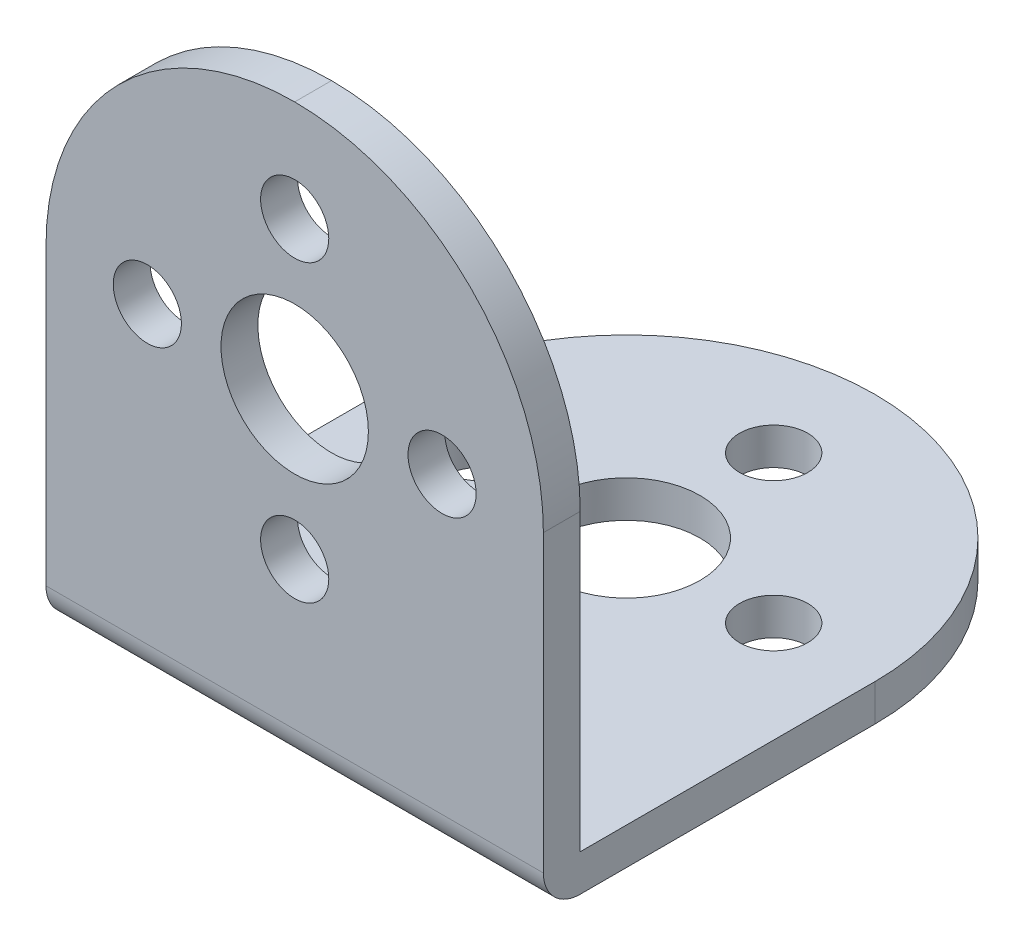
ISO-10303-21;
HEADER;
FILE_DESCRIPTION(('STEP AP214'),'2;1');
FILE_NAME('part.step','',(''),(''),'','','');
FILE_SCHEMA(('AUTOMOTIVE_DESIGN { 1 0 10303 214 1 1 1 1 }'));
ENDSEC;
DATA;
#1=APPLICATION_CONTEXT('core data for automotive mechanical design processes');
#2=APPLICATION_PROTOCOL_DEFINITION('international standard','automotive_design',2000,#1);
#3=PRODUCT_CONTEXT('',#1,'mechanical');
#4=PRODUCT('Part','Part','',(#3));
#5=PRODUCT_RELATED_PRODUCT_CATEGORY('part','',(#4));
#6=PRODUCT_DEFINITION_FORMATION('','',#4);
#7=PRODUCT_DEFINITION_CONTEXT('part definition',#1,'design');
#8=PRODUCT_DEFINITION('design','',#6,#7);
#9=PRODUCT_DEFINITION_SHAPE('','',#8);
#10=(LENGTH_UNIT() NAMED_UNIT(*) SI_UNIT(.MILLI.,.METRE.));
#11=(NAMED_UNIT(*) PLANE_ANGLE_UNIT() SI_UNIT($,.RADIAN.));
#12=(NAMED_UNIT(*) SI_UNIT($,.STERADIAN.) SOLID_ANGLE_UNIT());
#13=UNCERTAINTY_MEASURE_WITH_UNIT(LENGTH_MEASURE(1.E-05),#10,'distance_accuracy_value','');
#14=(GEOMETRIC_REPRESENTATION_CONTEXT(3) GLOBAL_UNCERTAINTY_ASSIGNED_CONTEXT((#13)) GLOBAL_UNIT_ASSIGNED_CONTEXT((#10,
#11,#12)) REPRESENTATION_CONTEXT('',''));
#15=CARTESIAN_POINT('',(0.,0.,0.));
#16=DIRECTION('',(0.,0.,1.));
#17=DIRECTION('',(1.,0.,0.));
#18=AXIS2_PLACEMENT_3D('',#15,#16,#17);
#19=CARTESIAN_POINT('',(-14.2564342321871,10.0253469559307,20.0384048243081));
#20=DIRECTION('',(0.,0.,1.));
#21=DIRECTION('',(0.,-1.,0.));
#22=AXIS2_PLACEMENT_3D('',#19,#20,#21);
#23=PLANE('',#22);
#24=CARTESIAN_POINT('',(-0.756434232187075,4.52534695593067,20.0384048243081));
#25=DIRECTION('',(0.,0.,1.));
#26=DIRECTION('',(1.,0.,0.));
#27=AXIS2_PLACEMENT_3D('',#24,#25,#26);
#28=CIRCLE('',#27,1.85);
#29=CARTESIAN_POINT('',(1.09356576781292,4.52534695593067,20.0384048243081));
#30=VERTEX_POINT('',#29);
#31=EDGE_CURVE('E156',#30,#30,#28,.T.);
#32=ORIENTED_EDGE('',*,*,#31,.F.);
#33=EDGE_LOOP('',(#32));
#34=FACE_BOUND('',#33,.T.);
#35=CARTESIAN_POINT('',(-0.756434232187075,-11.4746530440693,20.0384048243081));
#36=DIRECTION('',(0.,0.,1.));
#37=DIRECTION('',(1.,0.,0.));
#38=AXIS2_PLACEMENT_3D('',#35,#36,#37);
#39=CIRCLE('',#38,1.85);
#40=CARTESIAN_POINT('',(1.09356576781292,-11.4746530440693,20.0384048243081));
#41=VERTEX_POINT('',#40);
#42=EDGE_CURVE('E151',#41,#41,#39,.T.);
#43=ORIENTED_EDGE('',*,*,#42,.F.);
#44=EDGE_LOOP('',(#43));
#45=FACE_BOUND('',#44,.T.);
#46=CARTESIAN_POINT('',(-8.75643423218707,-3.47465304406933,20.0384048243081));
#47=DIRECTION('',(0.,0.,1.));
#48=DIRECTION('',(1.,0.,0.));
#49=AXIS2_PLACEMENT_3D('',#46,#47,#48);
#50=CIRCLE('',#49,1.85);
#51=CARTESIAN_POINT('',(-6.90643423218708,-3.47465304406933,20.0384048243081));
#52=VERTEX_POINT('',#51);
#53=EDGE_CURVE('E146',#52,#52,#50,.T.);
#54=ORIENTED_EDGE('',*,*,#53,.F.);
#55=EDGE_LOOP('',(#54));
#56=FACE_BOUND('',#55,.T.);
#57=CARTESIAN_POINT('',(7.24356576781292,-3.47465304406933,20.0384048243081));
#58=DIRECTION('',(0.,0.,1.));
#59=DIRECTION('',(1.,0.,0.));
#60=AXIS2_PLACEMENT_3D('',#57,#58,#59);
#61=CIRCLE('',#60,1.85);
#62=CARTESIAN_POINT('',(9.09356576781292,-3.47465304406933,20.0384048243081));
#63=VERTEX_POINT('',#62);
#64=EDGE_CURVE('E141',#63,#63,#61,.T.);
#65=ORIENTED_EDGE('',*,*,#64,.F.);
#66=EDGE_LOOP('',(#65));
#67=FACE_BOUND('',#66,.T.);
#68=CARTESIAN_POINT('',(-0.756434232187075,-3.47465304406933,20.0384048243081));
#69=DIRECTION('',(0.,0.,1.));
#70=DIRECTION('',(1.,0.,0.));
#71=AXIS2_PLACEMENT_3D('',#68,#69,#70);
#72=CIRCLE('',#71,4.);
#73=CARTESIAN_POINT('',(3.24356576781293,-3.47465304406933,20.0384048243081));
#74=VERTEX_POINT('',#73);
#75=EDGE_CURVE('E136',#74,#74,#72,.T.);
#76=ORIENTED_EDGE('',*,*,#75,.F.);
#77=EDGE_LOOP('',(#76));
#78=FACE_BOUND('',#77,.T.);
#79=DIRECTION('',(0.,-1.,0.));
#80=VECTOR('',#79,1.);
#81=CARTESIAN_POINT('',(-14.2564342321871,10.0253469559307,20.0384048243081));
#82=LINE('',#81,#80);
#83=CARTESIAN_POINT('',(-14.2564342321871,-3.47465304406933,20.0384048243081));
#84=VERTEX_POINT('',#83);
#85=CARTESIAN_POINT('',(-14.2564342321871,-19.4746530440693,20.0384048243081));
#86=VERTEX_POINT('',#85);
#87=EDGE_CURVE('E131',#84,#86,#82,.T.);
#88=ORIENTED_EDGE('',*,*,#87,.T.);
#89=DIRECTION('',(1.,0.,0.));
#90=VECTOR('',#89,1.);
#91=CARTESIAN_POINT('',(-14.2564342321871,-19.4746530440693,20.0384048243081));
#92=LINE('',#91,#90);
#93=CARTESIAN_POINT('',(12.7435657678129,-19.4746530440693,20.0384048243081));
#94=VERTEX_POINT('',#93);
#95=EDGE_CURVE('E202',#86,#94,#92,.T.);
#96=ORIENTED_EDGE('',*,*,#95,.T.);
#97=DIRECTION('',(0.,-1.,0.));
#98=VECTOR('',#97,1.);
#99=CARTESIAN_POINT('',(12.7435657678129,10.0253469559307,20.0384048243081));
#100=LINE('',#99,#98);
#101=CARTESIAN_POINT('',(12.7435657678129,-3.47465304406933,20.0384048243081));
#102=VERTEX_POINT('',#101);
#103=EDGE_CURVE('E120',#102,#94,#100,.T.);
#104=ORIENTED_EDGE('',*,*,#103,.F.);
#105=CARTESIAN_POINT('',(-0.756434232187075,-3.47465304406933,20.0384048243081));
#106=DIRECTION('',(0.,0.,1.));
#107=DIRECTION('',(0.,-1.,0.));
#108=AXIS2_PLACEMENT_3D('',#105,#106,#107);
#109=CIRCLE('',#108,13.5);
#110=CARTESIAN_POINT('',(-0.756434232187075,10.0253469559307,20.0384048243081));
#111=VERTEX_POINT('',#110);
#112=EDGE_CURVE('E160',#102,#111,#109,.T.);
#113=ORIENTED_EDGE('',*,*,#112,.T.);
#114=CARTESIAN_POINT('',(-0.756434232187075,-3.47465304406933,20.0384048243081));
#115=DIRECTION('',(0.,0.,1.));
#116=DIRECTION('',(0.,-1.,0.));
#117=AXIS2_PLACEMENT_3D('',#114,#115,#116);
#118=CIRCLE('',#117,13.5);
#119=EDGE_CURVE('E171',#111,#84,#118,.T.);
#120=ORIENTED_EDGE('',*,*,#119,.T.);
#121=EDGE_LOOP('',(#88,#96,#104,#113,#120));
#122=FACE_BOUND('',#121,.T.);
#123=ADVANCED_FACE('F16',(#34,#45,#56,#67,#78,#122),#23,.T.);
#124=CARTESIAN_POINT('',(-14.2564342321871,-19.4746530440693,18.0384048243081));
#125=DIRECTION('',(0.,0.,-1.));
#126=DIRECTION('',(0.,1.,0.));
#127=AXIS2_PLACEMENT_3D('',#124,#125,#126);
#128=PLANE('',#127);
#129=CARTESIAN_POINT('',(-0.756434232187075,4.52534695593067,18.0384048243081));
#130=DIRECTION('',(0.,0.,-1.));
#131=DIRECTION('',(0.,1.,0.));
#132=AXIS2_PLACEMENT_3D('',#129,#130,#131);
#133=CIRCLE('',#132,1.85);
#134=CARTESIAN_POINT('',(-0.756434232187075,6.37534695593067,18.0384048243081));
#135=VERTEX_POINT('',#134);
#136=EDGE_CURVE('E152',#135,#135,#133,.T.);
#137=ORIENTED_EDGE('',*,*,#136,.F.);
#138=EDGE_LOOP('',(#137));
#139=FACE_BOUND('',#138,.T.);
#140=CARTESIAN_POINT('',(-0.756434232187075,-11.4746530440693,18.0384048243081));
#141=DIRECTION('',(0.,0.,-1.));
#142=DIRECTION('',(0.,1.,0.));
#143=AXIS2_PLACEMENT_3D('',#140,#141,#142);
#144=CIRCLE('',#143,1.85);
#145=CARTESIAN_POINT('',(-0.756434232187075,-9.62465304406933,18.0384048243081));
#146=VERTEX_POINT('',#145);
#147=EDGE_CURVE('E147',#146,#146,#144,.T.);
#148=ORIENTED_EDGE('',*,*,#147,.F.);
#149=EDGE_LOOP('',(#148));
#150=FACE_BOUND('',#149,.T.);
#151=CARTESIAN_POINT('',(-8.75643423218707,-3.47465304406933,18.0384048243081));
#152=DIRECTION('',(0.,0.,-1.));
#153=DIRECTION('',(0.,1.,0.));
#154=AXIS2_PLACEMENT_3D('',#151,#152,#153);
#155=CIRCLE('',#154,1.85);
#156=CARTESIAN_POINT('',(-8.75643423218707,-1.62465304406933,18.0384048243081));
#157=VERTEX_POINT('',#156);
#158=EDGE_CURVE('E142',#157,#157,#155,.T.);
#159=ORIENTED_EDGE('',*,*,#158,.F.);
#160=EDGE_LOOP('',(#159));
#161=FACE_BOUND('',#160,.T.);
#162=CARTESIAN_POINT('',(7.24356576781292,-3.47465304406933,18.0384048243081));
#163=DIRECTION('',(0.,0.,-1.));
#164=DIRECTION('',(0.,1.,0.));
#165=AXIS2_PLACEMENT_3D('',#162,#163,#164);
#166=CIRCLE('',#165,1.85);
#167=CARTESIAN_POINT('',(7.24356576781292,-1.62465304406933,18.0384048243081));
#168=VERTEX_POINT('',#167);
#169=EDGE_CURVE('E137',#168,#168,#166,.T.);
#170=ORIENTED_EDGE('',*,*,#169,.F.);
#171=EDGE_LOOP('',(#170));
#172=FACE_BOUND('',#171,.T.);
#173=CARTESIAN_POINT('',(-0.756434232187075,-3.47465304406933,18.0384048243081));
#174=DIRECTION('',(0.,0.,-1.));
#175=DIRECTION('',(0.,1.,0.));
#176=AXIS2_PLACEMENT_3D('',#173,#174,#175);
#177=CIRCLE('',#176,4.);
#178=CARTESIAN_POINT('',(-0.756434232187075,0.525346955930675,18.0384048243081));
#179=VERTEX_POINT('',#178);
#180=EDGE_CURVE('E124',#179,#179,#177,.T.);
#181=ORIENTED_EDGE('',*,*,#180,.F.);
#182=EDGE_LOOP('',(#181));
#183=FACE_BOUND('',#182,.T.);
#184=DIRECTION('',(0.,1.,0.));
#185=VECTOR('',#184,1.);
#186=CARTESIAN_POINT('',(-14.2564342321871,-19.4746530440693,18.0384048243081));
#187=LINE('',#186,#185);
#188=CARTESIAN_POINT('',(-14.2564342321871,-19.4746530440693,18.0384048243081));
#189=VERTEX_POINT('',#188);
#190=CARTESIAN_POINT('',(-14.2564342321871,-3.47465304406933,18.0384048243081));
#191=VERTEX_POINT('',#190);
#192=EDGE_CURVE('E99',#189,#191,#187,.T.);
#193=ORIENTED_EDGE('',*,*,#192,.T.);
#194=CARTESIAN_POINT('',(-0.756434232187075,-3.47465304406933,18.0384048243081));
#195=DIRECTION('',(0.,0.,-1.));
#196=DIRECTION('',(0.,1.,0.));
#197=AXIS2_PLACEMENT_3D('',#194,#195,#196);
#198=CIRCLE('',#197,13.5);
#199=CARTESIAN_POINT('',(-0.756434232187075,10.0253469559307,18.0384048243081));
#200=VERTEX_POINT('',#199);
#201=EDGE_CURVE('E176',#191,#200,#198,.T.);
#202=ORIENTED_EDGE('',*,*,#201,.T.);
#203=CARTESIAN_POINT('',(-0.756434232187075,-3.47465304406933,18.0384048243081));
#204=DIRECTION('',(0.,0.,-1.));
#205=DIRECTION('',(0.,1.,0.));
#206=AXIS2_PLACEMENT_3D('',#203,#204,#205);
#207=CIRCLE('',#206,13.5);
#208=CARTESIAN_POINT('',(12.7435657678129,-3.47465304406933,18.0384048243081));
#209=VERTEX_POINT('',#208);
#210=EDGE_CURVE('E168',#200,#209,#207,.T.);
#211=ORIENTED_EDGE('',*,*,#210,.T.);
#212=DIRECTION('',(0.,1.,0.));
#213=VECTOR('',#212,1.);
#214=CARTESIAN_POINT('',(12.7435657678129,-19.4746530440693,18.0384048243081));
#215=LINE('',#214,#213);
#216=CARTESIAN_POINT('',(12.7435657678129,-19.4746530440693,18.0384048243081));
#217=VERTEX_POINT('',#216);
#218=EDGE_CURVE('E107',#217,#209,#215,.T.);
#219=ORIENTED_EDGE('',*,*,#218,.F.);
#220=DIRECTION('',(1.,0.,0.));
#221=VECTOR('',#220,1.);
#222=CARTESIAN_POINT('',(-14.2564342321871,-19.4746530440693,18.0384048243081));
#223=LINE('',#222,#221);
#224=EDGE_CURVE('E91',#189,#217,#223,.T.);
#225=ORIENTED_EDGE('',*,*,#224,.F.);
#226=EDGE_LOOP('',(#193,#202,#211,#219,#225));
#227=FACE_BOUND('',#226,.T.);
#228=ADVANCED_FACE('F104',(#139,#150,#161,#172,#183,#227),#128,.T.);
#229=CARTESIAN_POINT('',(-14.2564342321871,-19.4746530440693,-11.4615951756919));
#230=DIRECTION('',(0.,1.,0.));
#231=DIRECTION('',(0.,0.,1.));
#232=AXIS2_PLACEMENT_3D('',#229,#230,#231);
#233=PLANE('',#232);
#234=CARTESIAN_POINT('',(-0.756434232187075,-19.4746530440693,10.0384048243081));
#235=DIRECTION('',(0.,1.,0.));
#236=DIRECTION('',(0.,0.,1.));
#237=AXIS2_PLACEMENT_3D('',#234,#235,#236);
#238=CIRCLE('',#237,1.85);
#239=CARTESIAN_POINT('',(-0.756434232187075,-19.4746530440693,11.8884048243081));
#240=VERTEX_POINT('',#239);
#241=EDGE_CURVE('E301',#240,#240,#238,.T.);
#242=ORIENTED_EDGE('',*,*,#241,.F.);
#243=EDGE_LOOP('',(#242));
#244=FACE_BOUND('',#243,.T.);
#245=CARTESIAN_POINT('',(-0.756434232187075,-19.4746530440693,-5.96159517569185));
#246=DIRECTION('',(0.,1.,0.));
#247=DIRECTION('',(0.,0.,1.));
#248=AXIS2_PLACEMENT_3D('',#245,#246,#247);
#249=CIRCLE('',#248,1.85);
#250=CARTESIAN_POINT('',(-0.756434232187075,-19.4746530440693,-4.11159517569186));
#251=VERTEX_POINT('',#250);
#252=EDGE_CURVE('E314',#251,#251,#249,.T.);
#253=ORIENTED_EDGE('',*,*,#252,.F.);
#254=EDGE_LOOP('',(#253));
#255=FACE_BOUND('',#254,.T.);
#256=CARTESIAN_POINT('',(-8.75643423218707,-19.4746530440693,2.03840482430815));
#257=DIRECTION('',(0.,1.,0.));
#258=DIRECTION('',(0.,0.,1.));
#259=AXIS2_PLACEMENT_3D('',#256,#257,#258);
#260=CIRCLE('',#259,1.85);
#261=CARTESIAN_POINT('',(-8.75643423218707,-19.4746530440693,3.88840482430814));
#262=VERTEX_POINT('',#261);
#263=EDGE_CURVE('E322',#262,#262,#260,.T.);
#264=ORIENTED_EDGE('',*,*,#263,.F.);
#265=EDGE_LOOP('',(#264));
#266=FACE_BOUND('',#265,.T.);
#267=CARTESIAN_POINT('',(7.24356576781292,-19.4746530440693,2.03840482430815));
#268=DIRECTION('',(0.,1.,0.));
#269=DIRECTION('',(0.,0.,1.));
#270=AXIS2_PLACEMENT_3D('',#267,#268,#269);
#271=CIRCLE('',#270,1.85);
#272=CARTESIAN_POINT('',(7.24356576781292,-19.4746530440693,3.88840482430814));
#273=VERTEX_POINT('',#272);
#274=EDGE_CURVE('E330',#273,#273,#271,.T.);
#275=ORIENTED_EDGE('',*,*,#274,.F.);
#276=EDGE_LOOP('',(#275));
#277=FACE_BOUND('',#276,.T.);
#278=CARTESIAN_POINT('',(-0.756434232187075,-19.4746530440693,2.03840482430815));
#279=DIRECTION('',(0.,1.,0.));
#280=DIRECTION('',(0.,0.,1.));
#281=AXIS2_PLACEMENT_3D('',#278,#279,#280);
#282=CIRCLE('',#281,4.);
#283=CARTESIAN_POINT('',(-0.756434232187075,-19.4746530440693,6.03840482430815));
#284=VERTEX_POINT('',#283);
#285=EDGE_CURVE('E338',#284,#284,#282,.T.);
#286=ORIENTED_EDGE('',*,*,#285,.F.);
#287=EDGE_LOOP('',(#286));
#288=FACE_BOUND('',#287,.T.);
#289=CARTESIAN_POINT('',(-0.756434232187075,-19.4746530440693,2.03840482430814));
#290=DIRECTION('',(0.,1.,0.));
#291=DIRECTION('',(0.,0.,1.));
#292=AXIS2_PLACEMENT_3D('',#289,#290,#291);
#293=CIRCLE('',#292,13.5);
#294=CARTESIAN_POINT('',(12.7435657678129,-19.4746530440693,2.03840482430814));
#295=VERTEX_POINT('',#294);
#296=CARTESIAN_POINT('',(-0.756434232187075,-19.4746530440693,-11.4615951756919));
#297=VERTEX_POINT('',#296);
#298=EDGE_CURVE('E183',#295,#297,#293,.T.);
#299=ORIENTED_EDGE('',*,*,#298,.T.);
#300=CARTESIAN_POINT('',(-0.756434232187075,-19.4746530440693,2.03840482430814));
#301=DIRECTION('',(0.,1.,0.));
#302=DIRECTION('',(0.,0.,1.));
#303=AXIS2_PLACEMENT_3D('',#300,#301,#302);
#304=CIRCLE('',#303,13.5);
#305=CARTESIAN_POINT('',(-14.2564342321871,-19.4746530440693,2.03840482430814));
#306=VERTEX_POINT('',#305);
#307=EDGE_CURVE('E93',#297,#306,#304,.T.);
#308=ORIENTED_EDGE('',*,*,#307,.T.);
#309=DIRECTION('',(0.,0.,1.));
#310=VECTOR('',#309,1.);
#311=CARTESIAN_POINT('',(-14.2564342321871,-19.4746530440693,-11.4615951756919));
#312=LINE('',#311,#310);
#313=EDGE_CURVE('E86',#306,#189,#312,.T.);
#314=ORIENTED_EDGE('',*,*,#313,.T.);
#315=ORIENTED_EDGE('',*,*,#224,.T.);
#316=DIRECTION('',(0.,0.,1.));
#317=VECTOR('',#316,1.);
#318=CARTESIAN_POINT('',(12.7435657678129,-19.4746530440693,-11.4615951756919));
#319=LINE('',#318,#317);
#320=EDGE_CURVE('E127',#295,#217,#319,.T.);
#321=ORIENTED_EDGE('',*,*,#320,.F.);
#322=EDGE_LOOP('',(#299,#308,#314,#315,#321));
#323=FACE_BOUND('',#322,.T.);
#324=ADVANCED_FACE('F89',(#244,#255,#266,#277,#288,#323),#233,.T.);
#325=CARTESIAN_POINT('',(-14.2564342321871,-21.4746530440693,20.0384048243081));
#326=DIRECTION('',(0.,-1.,0.));
#327=DIRECTION('',(0.,0.,-1.));
#328=AXIS2_PLACEMENT_3D('',#325,#326,#327);
#329=PLANE('',#328);
#330=CARTESIAN_POINT('',(-0.756434232187075,-21.4746530440693,10.0384048243081));
#331=DIRECTION('',(0.,-1.,0.));
#332=DIRECTION('',(0.,0.,-1.));
#333=AXIS2_PLACEMENT_3D('',#330,#331,#332);
#334=CIRCLE('',#333,1.85);
#335=CARTESIAN_POINT('',(-0.756434232187075,-21.4746530440693,8.18840482430815));
#336=VERTEX_POINT('',#335);
#337=EDGE_CURVE('E304',#336,#336,#334,.T.);
#338=ORIENTED_EDGE('',*,*,#337,.F.);
#339=EDGE_LOOP('',(#338));
#340=FACE_BOUND('',#339,.T.);
#341=CARTESIAN_POINT('',(-0.756434232187075,-21.4746530440693,-5.96159517569185));
#342=DIRECTION('',(0.,-1.,0.));
#343=DIRECTION('',(0.,0.,-1.));
#344=AXIS2_PLACEMENT_3D('',#341,#342,#343);
#345=CIRCLE('',#344,1.85);
#346=CARTESIAN_POINT('',(-0.756434232187075,-21.4746530440693,-7.81159517569185));
#347=VERTEX_POINT('',#346);
#348=EDGE_CURVE('E308',#347,#347,#345,.T.);
#349=ORIENTED_EDGE('',*,*,#348,.F.);
#350=EDGE_LOOP('',(#349));
#351=FACE_BOUND('',#350,.T.);
#352=CARTESIAN_POINT('',(-8.75643423218707,-21.4746530440693,2.03840482430815));
#353=DIRECTION('',(0.,-1.,0.));
#354=DIRECTION('',(0.,0.,-1.));
#355=AXIS2_PLACEMENT_3D('',#352,#353,#354);
#356=CIRCLE('',#355,1.85);
#357=CARTESIAN_POINT('',(-8.75643423218707,-21.4746530440693,0.18840482430815));
#358=VERTEX_POINT('',#357);
#359=EDGE_CURVE('E318',#358,#358,#356,.T.);
#360=ORIENTED_EDGE('',*,*,#359,.F.);
#361=EDGE_LOOP('',(#360));
#362=FACE_BOUND('',#361,.T.);
#363=CARTESIAN_POINT('',(7.24356576781292,-21.4746530440693,2.03840482430815));
#364=DIRECTION('',(0.,-1.,0.));
#365=DIRECTION('',(0.,0.,-1.));
#366=AXIS2_PLACEMENT_3D('',#363,#364,#365);
#367=CIRCLE('',#366,1.85);
#368=CARTESIAN_POINT('',(7.24356576781292,-21.4746530440693,0.18840482430815));
#369=VERTEX_POINT('',#368);
#370=EDGE_CURVE('E326',#369,#369,#367,.T.);
#371=ORIENTED_EDGE('',*,*,#370,.F.);
#372=EDGE_LOOP('',(#371));
#373=FACE_BOUND('',#372,.T.);
#374=CARTESIAN_POINT('',(-0.756434232187075,-21.4746530440693,2.03840482430815));
#375=DIRECTION('',(0.,-1.,0.));
#376=DIRECTION('',(0.,0.,-1.));
#377=AXIS2_PLACEMENT_3D('',#374,#375,#376);
#378=CIRCLE('',#377,4.);
#379=CARTESIAN_POINT('',(-0.756434232187075,-21.4746530440693,-1.96159517569186));
#380=VERTEX_POINT('',#379);
#381=EDGE_CURVE('E334',#380,#380,#378,.T.);
#382=ORIENTED_EDGE('',*,*,#381,.F.);
#383=EDGE_LOOP('',(#382));
#384=FACE_BOUND('',#383,.T.);
#385=DIRECTION('',(0.,0.,-1.));
#386=VECTOR('',#385,1.);
#387=CARTESIAN_POINT('',(12.7435657678129,-21.4746530440693,20.0384048243081));
#388=LINE('',#387,#386);
#389=CARTESIAN_POINT('',(12.7435657678129,-21.4746530440693,18.0384048243081));
#390=VERTEX_POINT('',#389);
#391=CARTESIAN_POINT('',(12.7435657678129,-21.4746530440693,2.03840482430814));
#392=VERTEX_POINT('',#391);
#393=EDGE_CURVE('E123',#390,#392,#388,.T.);
#394=ORIENTED_EDGE('',*,*,#393,.F.);
#395=DIRECTION('',(1.,0.,0.));
#396=VECTOR('',#395,1.);
#397=CARTESIAN_POINT('',(-14.2564342321871,-21.4746530440693,18.0384048243081));
#398=LINE('',#397,#396);
#399=CARTESIAN_POINT('',(-14.2564342321871,-21.4746530440693,18.0384048243081));
#400=VERTEX_POINT('',#399);
#401=EDGE_CURVE('E25',#390,#400,#398,.F.);
#402=ORIENTED_EDGE('',*,*,#401,.T.);
#403=DIRECTION('',(0.,0.,-1.));
#404=VECTOR('',#403,1.);
#405=CARTESIAN_POINT('',(-14.2564342321871,-21.4746530440693,20.0384048243081));
#406=LINE('',#405,#404);
#407=CARTESIAN_POINT('',(-14.2564342321871,-21.4746530440693,2.03840482430814));
#408=VERTEX_POINT('',#407);
#409=EDGE_CURVE('E100',#400,#408,#406,.T.);
#410=ORIENTED_EDGE('',*,*,#409,.T.);
#411=CARTESIAN_POINT('',(-0.756434232187075,-21.4746530440693,2.03840482430814));
#412=DIRECTION('',(0.,-1.,0.));
#413=DIRECTION('',(0.,0.,-1.));
#414=AXIS2_PLACEMENT_3D('',#411,#412,#413);
#415=CIRCLE('',#414,13.5);
#416=CARTESIAN_POINT('',(-0.756434232187075,-21.4746530440693,-11.4615951756919));
#417=VERTEX_POINT('',#416);
#418=EDGE_CURVE('E199',#408,#417,#415,.T.);
#419=ORIENTED_EDGE('',*,*,#418,.T.);
#420=CARTESIAN_POINT('',(-0.756434232187075,-21.4746530440693,2.03840482430814));
#421=DIRECTION('',(0.,-1.,0.));
#422=DIRECTION('',(0.,0.,-1.));
#423=AXIS2_PLACEMENT_3D('',#420,#421,#422);
#424=CIRCLE('',#423,13.5);
#425=EDGE_CURVE('E190',#417,#392,#424,.T.);
#426=ORIENTED_EDGE('',*,*,#425,.T.);
#427=EDGE_LOOP('',(#394,#402,#410,#419,#426));
#428=FACE_BOUND('',#427,.T.);
#429=ADVANCED_FACE('F248',(#340,#351,#362,#373,#384,#428),#329,.T.);
#430=CARTESIAN_POINT('',(-14.2564342321871,-21.4746530440693,20.0384048243081));
#431=DIRECTION('',(1.,0.,0.));
#432=DIRECTION('',(0.,0.,-1.));
#433=AXIS2_PLACEMENT_3D('',#430,#431,#432);
#434=PLANE('',#433);
#435=ORIENTED_EDGE('',*,*,#409,.F.);
#436=CARTESIAN_POINT('',(-14.2564342321871,-19.4746530440693,18.0384048243081));
#437=DIRECTION('',(1.,0.,0.));
#438=DIRECTION('',(0.,0.,-1.));
#439=AXIS2_PLACEMENT_3D('',#436,#437,#438);
#440=CIRCLE('',#439,2.);
#441=EDGE_CURVE('E11',#400,#86,#440,.F.);
#442=ORIENTED_EDGE('',*,*,#441,.T.);
#443=ORIENTED_EDGE('',*,*,#87,.F.);
#444=DIRECTION('',(0.,0.,1.));
#445=VECTOR('',#444,1.);
#446=CARTESIAN_POINT('',(-14.2564342321871,-3.47465304406933,18.0384048243081));
#447=LINE('',#446,#445);
#448=EDGE_CURVE('E114',#84,#191,#447,.F.);
#449=ORIENTED_EDGE('',*,*,#448,.T.);
#450=ORIENTED_EDGE('',*,*,#192,.F.);
#451=ORIENTED_EDGE('',*,*,#313,.F.);
#452=DIRECTION('',(0.,1.,0.));
#453=VECTOR('',#452,1.);
#454=CARTESIAN_POINT('',(-14.2564342321871,-21.4746530440693,2.03840482430814));
#455=LINE('',#454,#453);
#456=EDGE_CURVE('E196',#306,#408,#455,.F.);
#457=ORIENTED_EDGE('',*,*,#456,.T.);
#458=EDGE_LOOP('',(#435,#442,#443,#449,#450,#451,#457));
#459=FACE_BOUND('',#458,.T.);
#460=ADVANCED_FACE('F111',(#459),#434,.F.);
#461=CARTESIAN_POINT('',(12.7435657678129,-21.4746530440693,20.0384048243081));
#462=DIRECTION('',(1.,0.,0.));
#463=DIRECTION('',(0.,0.,-1.));
#464=AXIS2_PLACEMENT_3D('',#461,#462,#463);
#465=PLANE('',#464);
#466=ORIENTED_EDGE('',*,*,#103,.T.);
#467=CARTESIAN_POINT('',(12.7435657678129,-19.4746530440693,18.0384048243081));
#468=DIRECTION('',(1.,0.,0.));
#469=DIRECTION('',(0.,0.,-1.));
#470=AXIS2_PLACEMENT_3D('',#467,#468,#469);
#471=CIRCLE('',#470,2.);
#472=EDGE_CURVE('E39',#94,#390,#471,.T.);
#473=ORIENTED_EDGE('',*,*,#472,.T.);
#474=ORIENTED_EDGE('',*,*,#393,.T.);
#475=DIRECTION('',(0.,1.,0.));
#476=VECTOR('',#475,1.);
#477=CARTESIAN_POINT('',(12.7435657678129,-21.4746530440693,2.03840482430814));
#478=LINE('',#477,#476);
#479=EDGE_CURVE('E179',#392,#295,#478,.T.);
#480=ORIENTED_EDGE('',*,*,#479,.T.);
#481=ORIENTED_EDGE('',*,*,#320,.T.);
#482=ORIENTED_EDGE('',*,*,#218,.T.);
#483=DIRECTION('',(0.,0.,1.));
#484=VECTOR('',#483,1.);
#485=CARTESIAN_POINT('',(12.7435657678129,-3.47465304406933,20.0384048243081));
#486=LINE('',#485,#484);
#487=EDGE_CURVE('E109',#209,#102,#486,.T.);
#488=ORIENTED_EDGE('',*,*,#487,.T.);
#489=EDGE_LOOP('',(#466,#473,#474,#480,#481,#482,#488));
#490=FACE_BOUND('',#489,.T.);
#491=ADVANCED_FACE('F216',(#490),#465,.T.);
#492=CARTESIAN_POINT('',(-0.756434232187075,-3.47465304406933,-11.4615951756919));
#493=DIRECTION('',(0.,0.,1.));
#494=DIRECTION('',(1.,0.,0.));
#495=AXIS2_PLACEMENT_3D('',#492,#493,#494);
#496=CYLINDRICAL_SURFACE('',#495,4.);
#497=ORIENTED_EDGE('',*,*,#180,.T.);
#498=EDGE_LOOP('',(#497));
#499=FACE_BOUND('',#498,.T.);
#500=ORIENTED_EDGE('',*,*,#75,.T.);
#501=EDGE_LOOP('',(#500));
#502=FACE_BOUND('',#501,.T.);
#503=ADVANCED_FACE('F257',(#499,#502),#496,.F.);
#504=CARTESIAN_POINT('',(7.24356576781292,-3.47465304406933,-11.4615951756919));
#505=DIRECTION('',(0.,0.,1.));
#506=DIRECTION('',(1.,0.,0.));
#507=AXIS2_PLACEMENT_3D('',#504,#505,#506);
#508=CYLINDRICAL_SURFACE('',#507,1.85);
#509=ORIENTED_EDGE('',*,*,#169,.T.);
#510=EDGE_LOOP('',(#509));
#511=FACE_BOUND('',#510,.T.);
#512=ORIENTED_EDGE('',*,*,#64,.T.);
#513=EDGE_LOOP('',(#512));
#514=FACE_BOUND('',#513,.T.);
#515=ADVANCED_FACE('F262',(#511,#514),#508,.F.);
#516=CARTESIAN_POINT('',(-8.75643423218707,-3.47465304406933,-11.4615951756919));
#517=DIRECTION('',(0.,0.,1.));
#518=DIRECTION('',(1.,0.,0.));
#519=AXIS2_PLACEMENT_3D('',#516,#517,#518);
#520=CYLINDRICAL_SURFACE('',#519,1.85);
#521=ORIENTED_EDGE('',*,*,#158,.T.);
#522=EDGE_LOOP('',(#521));
#523=FACE_BOUND('',#522,.T.);
#524=ORIENTED_EDGE('',*,*,#53,.T.);
#525=EDGE_LOOP('',(#524));
#526=FACE_BOUND('',#525,.T.);
#527=ADVANCED_FACE('F266',(#523,#526),#520,.F.);
#528=CARTESIAN_POINT('',(-0.756434232187075,-11.4746530440693,-11.4615951756919));
#529=DIRECTION('',(0.,0.,1.));
#530=DIRECTION('',(1.,0.,0.));
#531=AXIS2_PLACEMENT_3D('',#528,#529,#530);
#532=CYLINDRICAL_SURFACE('',#531,1.85);
#533=ORIENTED_EDGE('',*,*,#147,.T.);
#534=EDGE_LOOP('',(#533));
#535=FACE_BOUND('',#534,.T.);
#536=ORIENTED_EDGE('',*,*,#42,.T.);
#537=EDGE_LOOP('',(#536));
#538=FACE_BOUND('',#537,.T.);
#539=ADVANCED_FACE('F270',(#535,#538),#532,.F.);
#540=CARTESIAN_POINT('',(-0.756434232187075,4.52534695593067,-11.4615951756919));
#541=DIRECTION('',(0.,0.,1.));
#542=DIRECTION('',(1.,0.,0.));
#543=AXIS2_PLACEMENT_3D('',#540,#541,#542);
#544=CYLINDRICAL_SURFACE('',#543,1.85);
#545=ORIENTED_EDGE('',*,*,#136,.T.);
#546=EDGE_LOOP('',(#545));
#547=FACE_BOUND('',#546,.T.);
#548=ORIENTED_EDGE('',*,*,#31,.T.);
#549=EDGE_LOOP('',(#548));
#550=FACE_BOUND('',#549,.T.);
#551=ADVANCED_FACE('F274',(#547,#550),#544,.F.);
#552=CARTESIAN_POINT('',(-0.756434232187075,10.0253469559307,2.03840482430815));
#553=DIRECTION('',(0.,-1.,0.));
#554=DIRECTION('',(0.,0.,-1.));
#555=AXIS2_PLACEMENT_3D('',#552,#553,#554);
#556=CYLINDRICAL_SURFACE('',#555,4.);
#557=ORIENTED_EDGE('',*,*,#285,.T.);
#558=EDGE_LOOP('',(#557));
#559=FACE_BOUND('',#558,.T.);
#560=ORIENTED_EDGE('',*,*,#381,.T.);
#561=EDGE_LOOP('',(#560));
#562=FACE_BOUND('',#561,.T.);
#563=ADVANCED_FACE('F278',(#559,#562),#556,.F.);
#564=CARTESIAN_POINT('',(7.24356576781292,10.0253469559307,2.03840482430815));
#565=DIRECTION('',(0.,-1.,0.));
#566=DIRECTION('',(0.,0.,-1.));
#567=AXIS2_PLACEMENT_3D('',#564,#565,#566);
#568=CYLINDRICAL_SURFACE('',#567,1.85);
#569=ORIENTED_EDGE('',*,*,#274,.T.);
#570=EDGE_LOOP('',(#569));
#571=FACE_BOUND('',#570,.T.);
#572=ORIENTED_EDGE('',*,*,#370,.T.);
#573=EDGE_LOOP('',(#572));
#574=FACE_BOUND('',#573,.T.);
#575=ADVANCED_FACE('F282',(#571,#574),#568,.F.);
#576=CARTESIAN_POINT('',(-8.75643423218707,10.0253469559307,2.03840482430815));
#577=DIRECTION('',(0.,-1.,0.));
#578=DIRECTION('',(0.,0.,-1.));
#579=AXIS2_PLACEMENT_3D('',#576,#577,#578);
#580=CYLINDRICAL_SURFACE('',#579,1.85);
#581=ORIENTED_EDGE('',*,*,#263,.T.);
#582=EDGE_LOOP('',(#581));
#583=FACE_BOUND('',#582,.T.);
#584=ORIENTED_EDGE('',*,*,#359,.T.);
#585=EDGE_LOOP('',(#584));
#586=FACE_BOUND('',#585,.T.);
#587=ADVANCED_FACE('F286',(#583,#586),#580,.F.);
#588=CARTESIAN_POINT('',(-0.756434232187075,10.0253469559307,-5.96159517569185));
#589=DIRECTION('',(0.,-1.,0.));
#590=DIRECTION('',(0.,0.,-1.));
#591=AXIS2_PLACEMENT_3D('',#588,#589,#590);
#592=CYLINDRICAL_SURFACE('',#591,1.85);
#593=ORIENTED_EDGE('',*,*,#252,.T.);
#594=EDGE_LOOP('',(#593));
#595=FACE_BOUND('',#594,.T.);
#596=ORIENTED_EDGE('',*,*,#348,.T.);
#597=EDGE_LOOP('',(#596));
#598=FACE_BOUND('',#597,.T.);
#599=ADVANCED_FACE('F290',(#595,#598),#592,.F.);
#600=CARTESIAN_POINT('',(-0.756434232187075,10.0253469559307,10.0384048243081));
#601=DIRECTION('',(0.,-1.,0.));
#602=DIRECTION('',(0.,0.,-1.));
#603=AXIS2_PLACEMENT_3D('',#600,#601,#602);
#604=CYLINDRICAL_SURFACE('',#603,1.85);
#605=ORIENTED_EDGE('',*,*,#241,.T.);
#606=EDGE_LOOP('',(#605));
#607=FACE_BOUND('',#606,.T.);
#608=ORIENTED_EDGE('',*,*,#337,.T.);
#609=EDGE_LOOP('',(#608));
#610=FACE_BOUND('',#609,.T.);
#611=ADVANCED_FACE('F236',(#607,#610),#604,.F.);
#612=CARTESIAN_POINT('',(-0.756434232187075,-3.47465304406933,20.0384048243081));
#613=DIRECTION('',(0.,0.,1.));
#614=DIRECTION('',(1.,0.,0.));
#615=AXIS2_PLACEMENT_3D('',#612,#613,#614);
#616=CYLINDRICAL_SURFACE('',#615,13.5);
#617=ORIENTED_EDGE('',*,*,#210,.F.);
#618=DIRECTION('',(0.,0.,1.));
#619=VECTOR('',#618,1.);
#620=CARTESIAN_POINT('',(-0.756434232187075,10.0253469559307,18.0384048243081));
#621=LINE('',#620,#619);
#622=EDGE_CURVE('E164',#111,#200,#621,.F.);
#623=ORIENTED_EDGE('',*,*,#622,.F.);
#624=ORIENTED_EDGE('',*,*,#112,.F.);
#625=ORIENTED_EDGE('',*,*,#487,.F.);
#626=EDGE_LOOP('',(#617,#623,#624,#625));
#627=FACE_BOUND('',#626,.T.);
#628=ADVANCED_FACE('F220',(#627),#616,.T.);
#629=CARTESIAN_POINT('',(-0.756434232187075,-3.47465304406933,18.0384048243081));
#630=DIRECTION('',(0.,0.,-1.));
#631=DIRECTION('',(-1.,0.,0.));
#632=AXIS2_PLACEMENT_3D('',#629,#630,#631);
#633=CYLINDRICAL_SURFACE('',#632,13.5);
#634=ORIENTED_EDGE('',*,*,#201,.F.);
#635=ORIENTED_EDGE('',*,*,#448,.F.);
#636=ORIENTED_EDGE('',*,*,#119,.F.);
#637=ORIENTED_EDGE('',*,*,#622,.T.);
#638=EDGE_LOOP('',(#634,#635,#636,#637));
#639=FACE_BOUND('',#638,.T.);
#640=ADVANCED_FACE('F225',(#639),#633,.T.);
#641=CARTESIAN_POINT('',(-0.756434232187075,-21.4746530440693,2.03840482430814));
#642=DIRECTION('',(0.,1.,0.));
#643=DIRECTION('',(0.,0.,1.));
#644=AXIS2_PLACEMENT_3D('',#641,#642,#643);
#645=CYLINDRICAL_SURFACE('',#644,13.5);
#646=ORIENTED_EDGE('',*,*,#425,.F.);
#647=DIRECTION('',(0.,1.,0.));
#648=VECTOR('',#647,1.);
#649=CARTESIAN_POINT('',(-0.756434232187075,-21.4746530440693,-11.4615951756919));
#650=LINE('',#649,#648);
#651=EDGE_CURVE('E186',#297,#417,#650,.F.);
#652=ORIENTED_EDGE('',*,*,#651,.F.);
#653=ORIENTED_EDGE('',*,*,#298,.F.);
#654=ORIENTED_EDGE('',*,*,#479,.F.);
#655=EDGE_LOOP('',(#646,#652,#653,#654));
#656=FACE_BOUND('',#655,.T.);
#657=ADVANCED_FACE('F227',(#656),#645,.T.);
#658=CARTESIAN_POINT('',(-0.756434232187075,-21.4746530440693,2.03840482430814));
#659=DIRECTION('',(0.,-1.,0.));
#660=DIRECTION('',(0.,0.,-1.));
#661=AXIS2_PLACEMENT_3D('',#658,#659,#660);
#662=CYLINDRICAL_SURFACE('',#661,13.5);
#663=ORIENTED_EDGE('',*,*,#418,.F.);
#664=ORIENTED_EDGE('',*,*,#456,.F.);
#665=ORIENTED_EDGE('',*,*,#307,.F.);
#666=ORIENTED_EDGE('',*,*,#651,.T.);
#667=EDGE_LOOP('',(#663,#664,#665,#666));
#668=FACE_BOUND('',#667,.T.);
#669=ADVANCED_FACE('F233',(#668),#662,.T.);
#670=CARTESIAN_POINT('',(-14.2564342321871,-19.4746530440693,18.0384048243081));
#671=DIRECTION('',(1.,0.,0.));
#672=DIRECTION('',(0.,0.,-1.));
#673=AXIS2_PLACEMENT_3D('',#670,#671,#672);
#674=CYLINDRICAL_SURFACE('',#673,2.);
#675=ORIENTED_EDGE('',*,*,#441,.F.);
#676=ORIENTED_EDGE('',*,*,#401,.F.);
#677=ORIENTED_EDGE('',*,*,#472,.F.);
#678=ORIENTED_EDGE('',*,*,#95,.F.);
#679=EDGE_LOOP('',(#675,#676,#677,#678));
#680=FACE_BOUND('',#679,.T.);
#681=ADVANCED_FACE('F18',(#680),#674,.T.);
#682=CLOSED_SHELL('',(#123,#228,#324,#429,#460,#491,#503,#515,#527,#539,#551,#563,#575,#587,
#599,#611,#628,#640,#657,#669,#681));
#683=MANIFOLD_SOLID_BREP('B1',#682);
#684=ADVANCED_BREP_SHAPE_REPRESENTATION('',(#18,#683),#14);
#685=SHAPE_DEFINITION_REPRESENTATION(#9,#684);
ENDSEC;
END-ISO-10303-21;
